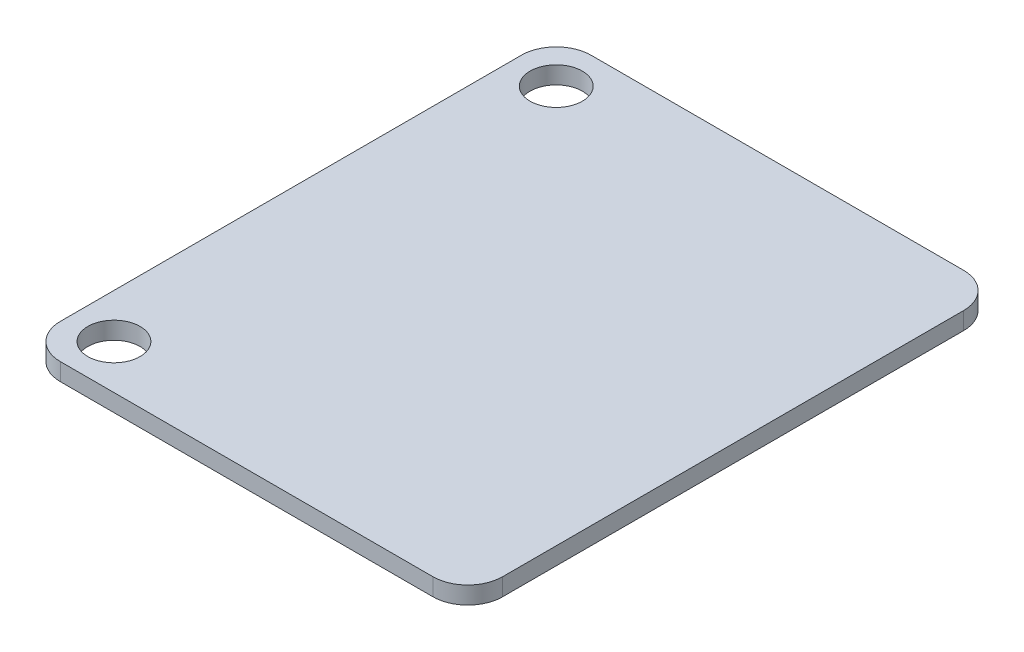
ISO-10303-21;
HEADER;
FILE_DESCRIPTION(('STEP AP214'),'2;1');
FILE_NAME('part.step','',(''),(''),'','','');
FILE_SCHEMA(('AUTOMOTIVE_DESIGN { 1 0 10303 214 1 1 1 1 }'));
ENDSEC;
DATA;
#1=APPLICATION_CONTEXT('core data for automotive mechanical design processes');
#2=APPLICATION_PROTOCOL_DEFINITION('international standard','automotive_design',2000,#1);
#3=PRODUCT_CONTEXT('',#1,'mechanical');
#4=PRODUCT('Part','Part','',(#3));
#5=PRODUCT_RELATED_PRODUCT_CATEGORY('part','',(#4));
#6=PRODUCT_DEFINITION_FORMATION('','',#4);
#7=PRODUCT_DEFINITION_CONTEXT('part definition',#1,'design');
#8=PRODUCT_DEFINITION('design','',#6,#7);
#9=PRODUCT_DEFINITION_SHAPE('','',#8);
#10=(LENGTH_UNIT() NAMED_UNIT(*) SI_UNIT(.MILLI.,.METRE.));
#11=(NAMED_UNIT(*) PLANE_ANGLE_UNIT() SI_UNIT($,.RADIAN.));
#12=(NAMED_UNIT(*) SI_UNIT($,.STERADIAN.) SOLID_ANGLE_UNIT());
#13=UNCERTAINTY_MEASURE_WITH_UNIT(LENGTH_MEASURE(1.E-05),#10,'distance_accuracy_value','');
#14=(GEOMETRIC_REPRESENTATION_CONTEXT(3) GLOBAL_UNCERTAINTY_ASSIGNED_CONTEXT((#13)) GLOBAL_UNIT_ASSIGNED_CONTEXT((#10,
#11,#12)) REPRESENTATION_CONTEXT('',''));
#15=CARTESIAN_POINT('',(0.,0.,0.));
#16=DIRECTION('',(0.,0.,1.));
#17=DIRECTION('',(1.,0.,0.));
#18=AXIS2_PLACEMENT_3D('',#15,#16,#17);
#19=CARTESIAN_POINT('',(0.,1.,0.));
#20=DIRECTION('',(0.,-1.,0.));
#21=DIRECTION('',(0.,0.,-1.));
#22=AXIS2_PLACEMENT_3D('',#19,#20,#21);
#23=PLANE('',#22);
#24=CARTESIAN_POINT('',(-9.97996296625324,1.,-13.7540017855127));
#25=DIRECTION('',(0.,1.,0.));
#26=DIRECTION('',(0.,0.,1.));
#27=AXIS2_PLACEMENT_3D('',#24,#25,#26);
#28=CIRCLE('',#27,1.5);
#29=CARTESIAN_POINT('',(-9.97996296625324,1.,-12.2540017855127));
#30=VERTEX_POINT('',#29);
#31=EDGE_CURVE('E127',#30,#30,#28,.T.);
#32=ORIENTED_EDGE('',*,*,#31,.F.);
#33=EDGE_LOOP('',(#32));
#34=FACE_BOUND('',#33,.T.);
#35=DIRECTION('',(-1.,0.,0.));
#36=VECTOR('',#35,1.);
#37=CARTESIAN_POINT('',(-12.5199629662532,1.,-16.2940017855127));
#38=LINE('',#37,#36);
#39=CARTESIAN_POINT('',(10.8800370337468,1.,-16.2940017855127));
#40=VERTEX_POINT('',#39);
#41=CARTESIAN_POINT('',(-10.5199629662532,1.,-16.2940017855127));
#42=VERTEX_POINT('',#41);
#43=EDGE_CURVE('E115',#40,#42,#38,.T.);
#44=ORIENTED_EDGE('',*,*,#43,.T.);
#45=CARTESIAN_POINT('',(-10.5199629662532,1.,-14.2940017855127));
#46=DIRECTION('',(0.,-1.,0.));
#47=DIRECTION('',(0.,0.,-1.));
#48=AXIS2_PLACEMENT_3D('',#45,#46,#47);
#49=CIRCLE('',#48,2.);
#50=CARTESIAN_POINT('',(-12.5199629662532,1.,-14.2940017855127));
#51=VERTEX_POINT('',#50);
#52=EDGE_CURVE('E11',#42,#51,#49,.F.);
#53=ORIENTED_EDGE('',*,*,#52,.T.);
#54=DIRECTION('',(0.,0.,1.));
#55=VECTOR('',#54,1.);
#56=CARTESIAN_POINT('',(-12.5199629662532,1.,14.1859982144873));
#57=LINE('',#56,#55);
#58=CARTESIAN_POINT('',(-12.5199629662532,1.,12.1859982144873));
#59=VERTEX_POINT('',#58);
#60=EDGE_CURVE('E131',#51,#59,#57,.T.);
#61=ORIENTED_EDGE('',*,*,#60,.T.);
#62=CARTESIAN_POINT('',(-10.5199629662532,1.,12.1859982144873));
#63=DIRECTION('',(0.,-1.,0.));
#64=DIRECTION('',(0.,0.,-1.));
#65=AXIS2_PLACEMENT_3D('',#62,#63,#64);
#66=CIRCLE('',#65,2.);
#67=CARTESIAN_POINT('',(-10.5199629662532,1.,14.1859982144873));
#68=VERTEX_POINT('',#67);
#69=EDGE_CURVE('E134',#59,#68,#66,.F.);
#70=ORIENTED_EDGE('',*,*,#69,.T.);
#71=DIRECTION('',(1.,0.,0.));
#72=VECTOR('',#71,1.);
#73=CARTESIAN_POINT('',(-12.5199629662532,1.,14.1859982144873));
#74=LINE('',#73,#72);
#75=CARTESIAN_POINT('',(10.8800370337468,1.,14.1859982144873));
#76=VERTEX_POINT('',#75);
#77=EDGE_CURVE('E114',#68,#76,#74,.T.);
#78=ORIENTED_EDGE('',*,*,#77,.T.);
#79=CARTESIAN_POINT('',(10.8800370337468,1.,12.1859982144873));
#80=DIRECTION('',(0.,-1.,0.));
#81=DIRECTION('',(0.,0.,-1.));
#82=AXIS2_PLACEMENT_3D('',#79,#80,#81);
#83=CIRCLE('',#82,2.);
#84=CARTESIAN_POINT('',(12.8800370337468,1.,12.1859982144873));
#85=VERTEX_POINT('',#84);
#86=EDGE_CURVE('E142',#76,#85,#83,.F.);
#87=ORIENTED_EDGE('',*,*,#86,.T.);
#88=DIRECTION('',(0.,0.,-1.));
#89=VECTOR('',#88,1.);
#90=CARTESIAN_POINT('',(12.8800370337468,1.,14.1859982144873));
#91=LINE('',#90,#89);
#92=CARTESIAN_POINT('',(12.8800370337468,1.,-14.2940017855127));
#93=VERTEX_POINT('',#92);
#94=EDGE_CURVE('E167',#85,#93,#91,.T.);
#95=ORIENTED_EDGE('',*,*,#94,.T.);
#96=CARTESIAN_POINT('',(10.8800370337468,1.,-14.2940017855127));
#97=DIRECTION('',(0.,-1.,0.));
#98=DIRECTION('',(0.,0.,-1.));
#99=AXIS2_PLACEMENT_3D('',#96,#97,#98);
#100=CIRCLE('',#99,2.);
#101=EDGE_CURVE('E151',#93,#40,#100,.F.);
#102=ORIENTED_EDGE('',*,*,#101,.T.);
#103=EDGE_LOOP('',(#44,#53,#61,#70,#78,#87,#95,#102));
#104=FACE_BOUND('',#103,.T.);
#105=CARTESIAN_POINT('',(-9.97996296625324,1.,11.6459982144873));
#106=DIRECTION('',(0.,1.,0.));
#107=DIRECTION('',(0.,0.,1.));
#108=AXIS2_PLACEMENT_3D('',#105,#106,#107);
#109=CIRCLE('',#108,1.5);
#110=CARTESIAN_POINT('',(-9.97996296625324,1.,13.1459982144873));
#111=VERTEX_POINT('',#110);
#112=EDGE_CURVE('E175',#111,#111,#109,.T.);
#113=ORIENTED_EDGE('',*,*,#112,.F.);
#114=EDGE_LOOP('',(#113));
#115=FACE_BOUND('',#114,.T.);
#116=ADVANCED_FACE('F32',(#34,#104,#115),#23,.F.);
#117=CARTESIAN_POINT('',(0.,0.,0.));
#118=DIRECTION('',(0.,-1.,0.));
#119=DIRECTION('',(0.,0.,-1.));
#120=AXIS2_PLACEMENT_3D('',#117,#118,#119);
#121=PLANE('',#120);
#122=CARTESIAN_POINT('',(-9.97996296625324,0.,-13.7540017855127));
#123=DIRECTION('',(0.,1.,0.));
#124=DIRECTION('',(0.,0.,1.));
#125=AXIS2_PLACEMENT_3D('',#122,#123,#124);
#126=CIRCLE('',#125,1.5);
#127=CARTESIAN_POINT('',(-9.97996296625324,0.,-12.2540017855127));
#128=VERTEX_POINT('',#127);
#129=EDGE_CURVE('E172',#128,#128,#126,.T.);
#130=ORIENTED_EDGE('',*,*,#129,.T.);
#131=EDGE_LOOP('',(#130));
#132=FACE_BOUND('',#131,.T.);
#133=DIRECTION('',(0.,0.,1.));
#134=VECTOR('',#133,1.);
#135=CARTESIAN_POINT('',(-12.5199629662532,0.,14.1859982144873));
#136=LINE('',#135,#134);
#137=CARTESIAN_POINT('',(-12.5199629662532,0.,-14.2940017855127));
#138=VERTEX_POINT('',#137);
#139=CARTESIAN_POINT('',(-12.5199629662532,0.,12.1859982144873));
#140=VERTEX_POINT('',#139);
#141=EDGE_CURVE('E122',#138,#140,#136,.T.);
#142=ORIENTED_EDGE('',*,*,#141,.F.);
#143=CARTESIAN_POINT('',(-10.5199629662532,0.,-14.2940017855127));
#144=DIRECTION('',(0.,-1.,0.));
#145=DIRECTION('',(0.,0.,-1.));
#146=AXIS2_PLACEMENT_3D('',#143,#144,#145);
#147=CIRCLE('',#146,2.);
#148=CARTESIAN_POINT('',(-10.5199629662532,0.,-16.2940017855127));
#149=VERTEX_POINT('',#148);
#150=EDGE_CURVE('E54',#138,#149,#147,.T.);
#151=ORIENTED_EDGE('',*,*,#150,.T.);
#152=DIRECTION('',(-1.,0.,0.));
#153=VECTOR('',#152,1.);
#154=CARTESIAN_POINT('',(-12.5199629662532,0.,-16.2940017855127));
#155=LINE('',#154,#153);
#156=CARTESIAN_POINT('',(10.8800370337468,0.,-16.2940017855127));
#157=VERTEX_POINT('',#156);
#158=EDGE_CURVE('E125',#157,#149,#155,.T.);
#159=ORIENTED_EDGE('',*,*,#158,.F.);
#160=CARTESIAN_POINT('',(10.8800370337468,0.,-14.2940017855127));
#161=DIRECTION('',(0.,-1.,0.));
#162=DIRECTION('',(0.,0.,-1.));
#163=AXIS2_PLACEMENT_3D('',#160,#161,#162);
#164=CIRCLE('',#163,2.);
#165=CARTESIAN_POINT('',(12.8800370337468,0.,-14.2940017855127));
#166=VERTEX_POINT('',#165);
#167=EDGE_CURVE('E147',#157,#166,#164,.T.);
#168=ORIENTED_EDGE('',*,*,#167,.T.);
#169=DIRECTION('',(0.,0.,-1.));
#170=VECTOR('',#169,1.);
#171=CARTESIAN_POINT('',(12.8800370337468,0.,14.1859982144873));
#172=LINE('',#171,#170);
#173=CARTESIAN_POINT('',(12.8800370337468,0.,12.1859982144873));
#174=VERTEX_POINT('',#173);
#175=EDGE_CURVE('E121',#174,#166,#172,.T.);
#176=ORIENTED_EDGE('',*,*,#175,.F.);
#177=CARTESIAN_POINT('',(10.8800370337468,0.,12.1859982144873));
#178=DIRECTION('',(0.,-1.,0.));
#179=DIRECTION('',(0.,0.,-1.));
#180=AXIS2_PLACEMENT_3D('',#177,#178,#179);
#181=CIRCLE('',#180,2.);
#182=CARTESIAN_POINT('',(10.8800370337468,0.,14.1859982144873));
#183=VERTEX_POINT('',#182);
#184=EDGE_CURVE('E120',#174,#183,#181,.T.);
#185=ORIENTED_EDGE('',*,*,#184,.T.);
#186=DIRECTION('',(1.,0.,0.));
#187=VECTOR('',#186,1.);
#188=CARTESIAN_POINT('',(-12.5199629662532,0.,14.1859982144873));
#189=LINE('',#188,#187);
#190=CARTESIAN_POINT('',(-10.5199629662532,0.,14.1859982144873));
#191=VERTEX_POINT('',#190);
#192=EDGE_CURVE('E111',#191,#183,#189,.T.);
#193=ORIENTED_EDGE('',*,*,#192,.F.);
#194=CARTESIAN_POINT('',(-10.5199629662532,0.,12.1859982144873));
#195=DIRECTION('',(0.,-1.,0.));
#196=DIRECTION('',(0.,0.,-1.));
#197=AXIS2_PLACEMENT_3D('',#194,#195,#196);
#198=CIRCLE('',#197,2.);
#199=EDGE_CURVE('E98',#191,#140,#198,.T.);
#200=ORIENTED_EDGE('',*,*,#199,.T.);
#201=EDGE_LOOP('',(#142,#151,#159,#168,#176,#185,#193,#200));
#202=FACE_BOUND('',#201,.T.);
#203=CARTESIAN_POINT('',(-9.97996296625324,0.,11.6459982144873));
#204=DIRECTION('',(0.,1.,0.));
#205=DIRECTION('',(0.,0.,1.));
#206=AXIS2_PLACEMENT_3D('',#203,#204,#205);
#207=CIRCLE('',#206,1.5);
#208=CARTESIAN_POINT('',(-9.97996296625324,0.,13.1459982144873));
#209=VERTEX_POINT('',#208);
#210=EDGE_CURVE('E178',#209,#209,#207,.T.);
#211=ORIENTED_EDGE('',*,*,#210,.T.);
#212=EDGE_LOOP('',(#211));
#213=FACE_BOUND('',#212,.T.);
#214=ADVANCED_FACE('F117',(#132,#202,#213),#121,.T.);
#215=CARTESIAN_POINT('',(-12.5199629662532,1.,14.1859982144873));
#216=DIRECTION('',(1.,0.,0.));
#217=DIRECTION('',(0.,0.,-1.));
#218=AXIS2_PLACEMENT_3D('',#215,#216,#217);
#219=PLANE('',#218);
#220=ORIENTED_EDGE('',*,*,#60,.F.);
#221=DIRECTION('',(0.,-1.,0.));
#222=VECTOR('',#221,1.);
#223=CARTESIAN_POINT('',(-12.5199629662532,1.,-14.2940017855127));
#224=LINE('',#223,#222);
#225=EDGE_CURVE('E153',#51,#138,#224,.T.);
#226=ORIENTED_EDGE('',*,*,#225,.T.);
#227=ORIENTED_EDGE('',*,*,#141,.T.);
#228=DIRECTION('',(0.,-1.,0.));
#229=VECTOR('',#228,1.);
#230=CARTESIAN_POINT('',(-12.5199629662532,1.,12.1859982144873));
#231=LINE('',#230,#229);
#232=EDGE_CURVE('E104',#140,#59,#231,.F.);
#233=ORIENTED_EDGE('',*,*,#232,.T.);
#234=EDGE_LOOP('',(#220,#226,#227,#233));
#235=FACE_BOUND('',#234,.T.);
#236=ADVANCED_FACE('F159',(#235),#219,.F.);
#237=CARTESIAN_POINT('',(-12.5199629662532,1.,14.1859982144873));
#238=DIRECTION('',(0.,0.,-1.));
#239=DIRECTION('',(-1.,0.,0.));
#240=AXIS2_PLACEMENT_3D('',#237,#238,#239);
#241=PLANE('',#240);
#242=ORIENTED_EDGE('',*,*,#192,.T.);
#243=DIRECTION('',(0.,-1.,0.));
#244=VECTOR('',#243,1.);
#245=CARTESIAN_POINT('',(10.8800370337468,1.,14.1859982144873));
#246=LINE('',#245,#244);
#247=EDGE_CURVE('E140',#183,#76,#246,.F.);
#248=ORIENTED_EDGE('',*,*,#247,.T.);
#249=ORIENTED_EDGE('',*,*,#77,.F.);
#250=DIRECTION('',(0.,-1.,0.));
#251=VECTOR('',#250,1.);
#252=CARTESIAN_POINT('',(-10.5199629662532,1.,14.1859982144873));
#253=LINE('',#252,#251);
#254=EDGE_CURVE('E102',#68,#191,#253,.T.);
#255=ORIENTED_EDGE('',*,*,#254,.T.);
#256=EDGE_LOOP('',(#242,#248,#249,#255));
#257=FACE_BOUND('',#256,.T.);
#258=ADVANCED_FACE('F110',(#257),#241,.F.);
#259=CARTESIAN_POINT('',(12.8800370337468,1.,14.1859982144873));
#260=DIRECTION('',(-1.,0.,0.));
#261=DIRECTION('',(0.,0.,1.));
#262=AXIS2_PLACEMENT_3D('',#259,#260,#261);
#263=PLANE('',#262);
#264=ORIENTED_EDGE('',*,*,#175,.T.);
#265=DIRECTION('',(0.,-1.,0.));
#266=VECTOR('',#265,1.);
#267=CARTESIAN_POINT('',(12.8800370337468,1.,-14.2940017855127));
#268=LINE('',#267,#266);
#269=EDGE_CURVE('E149',#166,#93,#268,.F.);
#270=ORIENTED_EDGE('',*,*,#269,.T.);
#271=ORIENTED_EDGE('',*,*,#94,.F.);
#272=DIRECTION('',(0.,-1.,0.));
#273=VECTOR('',#272,1.);
#274=CARTESIAN_POINT('',(12.8800370337468,1.,12.1859982144873));
#275=LINE('',#274,#273);
#276=EDGE_CURVE('E136',#85,#174,#275,.T.);
#277=ORIENTED_EDGE('',*,*,#276,.T.);
#278=EDGE_LOOP('',(#264,#270,#271,#277));
#279=FACE_BOUND('',#278,.T.);
#280=ADVANCED_FACE('F202',(#279),#263,.F.);
#281=CARTESIAN_POINT('',(-12.5199629662532,1.,-16.2940017855127));
#282=DIRECTION('',(0.,0.,1.));
#283=DIRECTION('',(1.,0.,0.));
#284=AXIS2_PLACEMENT_3D('',#281,#282,#283);
#285=PLANE('',#284);
#286=ORIENTED_EDGE('',*,*,#158,.T.);
#287=DIRECTION('',(0.,-1.,0.));
#288=VECTOR('',#287,1.);
#289=CARTESIAN_POINT('',(-10.5199629662532,1.,-16.2940017855127));
#290=LINE('',#289,#288);
#291=EDGE_CURVE('E40',#149,#42,#290,.F.);
#292=ORIENTED_EDGE('',*,*,#291,.T.);
#293=ORIENTED_EDGE('',*,*,#43,.F.);
#294=DIRECTION('',(0.,-1.,0.));
#295=VECTOR('',#294,1.);
#296=CARTESIAN_POINT('',(10.8800370337468,1.,-16.2940017855127));
#297=LINE('',#296,#295);
#298=EDGE_CURVE('E144',#40,#157,#297,.T.);
#299=ORIENTED_EDGE('',*,*,#298,.T.);
#300=EDGE_LOOP('',(#286,#292,#293,#299));
#301=FACE_BOUND('',#300,.T.);
#302=ADVANCED_FACE('F199',(#301),#285,.F.);
#303=CARTESIAN_POINT('',(-9.97996296625324,1.,-13.7540017855127));
#304=DIRECTION('',(0.,-1.,0.));
#305=DIRECTION('',(0.,0.,-1.));
#306=AXIS2_PLACEMENT_3D('',#303,#304,#305);
#307=CYLINDRICAL_SURFACE('',#306,1.5);
#308=ORIENTED_EDGE('',*,*,#31,.T.);
#309=EDGE_LOOP('',(#308));
#310=FACE_BOUND('',#309,.T.);
#311=ORIENTED_EDGE('',*,*,#129,.F.);
#312=EDGE_LOOP('',(#311));
#313=FACE_BOUND('',#312,.T.);
#314=ADVANCED_FACE('F196',(#310,#313),#307,.F.);
#315=CARTESIAN_POINT('',(-9.97996296625324,1.,11.6459982144873));
#316=DIRECTION('',(0.,-1.,0.));
#317=DIRECTION('',(0.,0.,-1.));
#318=AXIS2_PLACEMENT_3D('',#315,#316,#317);
#319=CYLINDRICAL_SURFACE('',#318,1.5);
#320=ORIENTED_EDGE('',*,*,#112,.T.);
#321=EDGE_LOOP('',(#320));
#322=FACE_BOUND('',#321,.T.);
#323=ORIENTED_EDGE('',*,*,#210,.F.);
#324=EDGE_LOOP('',(#323));
#325=FACE_BOUND('',#324,.T.);
#326=ADVANCED_FACE('F184',(#322,#325),#319,.F.);
#327=CARTESIAN_POINT('',(-10.5199629662532,1.,12.1859982144873));
#328=DIRECTION('',(0.,-1.,0.));
#329=DIRECTION('',(0.,0.,-1.));
#330=AXIS2_PLACEMENT_3D('',#327,#328,#329);
#331=CYLINDRICAL_SURFACE('',#330,2.);
#332=ORIENTED_EDGE('',*,*,#69,.F.);
#333=ORIENTED_EDGE('',*,*,#232,.F.);
#334=ORIENTED_EDGE('',*,*,#199,.F.);
#335=ORIENTED_EDGE('',*,*,#254,.F.);
#336=EDGE_LOOP('',(#332,#333,#334,#335));
#337=FACE_BOUND('',#336,.T.);
#338=ADVANCED_FACE('F101',(#337),#331,.T.);
#339=CARTESIAN_POINT('',(10.8800370337468,1.,12.1859982144873));
#340=DIRECTION('',(0.,-1.,0.));
#341=DIRECTION('',(0.,0.,-1.));
#342=AXIS2_PLACEMENT_3D('',#339,#340,#341);
#343=CYLINDRICAL_SURFACE('',#342,2.);
#344=ORIENTED_EDGE('',*,*,#86,.F.);
#345=ORIENTED_EDGE('',*,*,#247,.F.);
#346=ORIENTED_EDGE('',*,*,#184,.F.);
#347=ORIENTED_EDGE('',*,*,#276,.F.);
#348=EDGE_LOOP('',(#344,#345,#346,#347));
#349=FACE_BOUND('',#348,.T.);
#350=ADVANCED_FACE('F212',(#349),#343,.T.);
#351=CARTESIAN_POINT('',(10.8800370337468,1.,-14.2940017855127));
#352=DIRECTION('',(0.,-1.,0.));
#353=DIRECTION('',(0.,0.,-1.));
#354=AXIS2_PLACEMENT_3D('',#351,#352,#353);
#355=CYLINDRICAL_SURFACE('',#354,2.);
#356=ORIENTED_EDGE('',*,*,#101,.F.);
#357=ORIENTED_EDGE('',*,*,#269,.F.);
#358=ORIENTED_EDGE('',*,*,#167,.F.);
#359=ORIENTED_EDGE('',*,*,#298,.F.);
#360=EDGE_LOOP('',(#356,#357,#358,#359));
#361=FACE_BOUND('',#360,.T.);
#362=ADVANCED_FACE('F214',(#361),#355,.T.);
#363=CARTESIAN_POINT('',(-10.5199629662532,1.,-14.2940017855127));
#364=DIRECTION('',(0.,-1.,0.));
#365=DIRECTION('',(0.,0.,-1.));
#366=AXIS2_PLACEMENT_3D('',#363,#364,#365);
#367=CYLINDRICAL_SURFACE('',#366,2.);
#368=ORIENTED_EDGE('',*,*,#52,.F.);
#369=ORIENTED_EDGE('',*,*,#291,.F.);
#370=ORIENTED_EDGE('',*,*,#150,.F.);
#371=ORIENTED_EDGE('',*,*,#225,.F.);
#372=EDGE_LOOP('',(#368,#369,#370,#371));
#373=FACE_BOUND('',#372,.T.);
#374=ADVANCED_FACE('F34',(#373),#367,.T.);
#375=CLOSED_SHELL('',(#116,#214,#236,#258,#280,#302,#314,#326,#338,#350,#362,#374));
#376=MANIFOLD_SOLID_BREP('B2',#375);
#377=ADVANCED_BREP_SHAPE_REPRESENTATION('',(#18,#376),#14);
#378=SHAPE_DEFINITION_REPRESENTATION(#9,#377);
ENDSEC;
END-ISO-10303-21;
